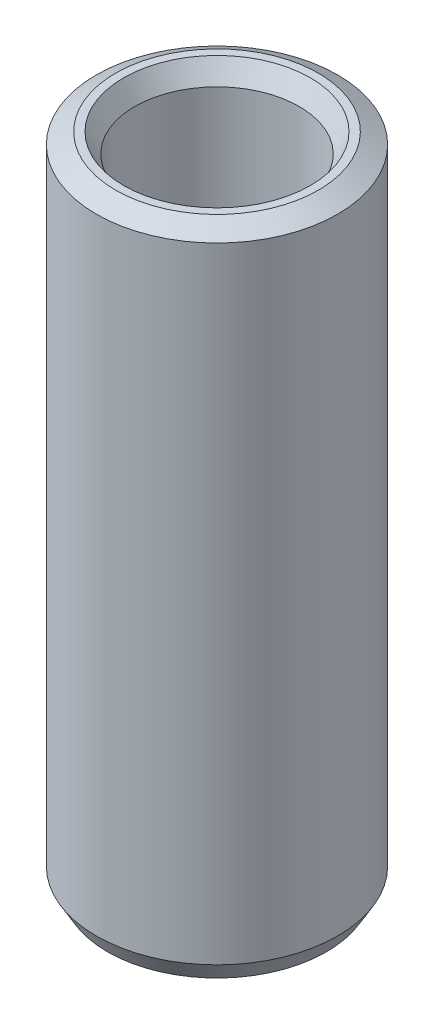
ISO-10303-21;
HEADER;
FILE_DESCRIPTION(('STEP AP214'),'2;1');
FILE_NAME('part.step','',(''),(''),'','','');
FILE_SCHEMA(('AUTOMOTIVE_DESIGN { 1 0 10303 214 1 1 1 1 }'));
ENDSEC;
DATA;
#1=APPLICATION_CONTEXT('core data for automotive mechanical design processes');
#2=APPLICATION_PROTOCOL_DEFINITION('international standard','automotive_design',2000,#1);
#3=PRODUCT_CONTEXT('',#1,'mechanical');
#4=PRODUCT('Part','Part','',(#3));
#5=PRODUCT_RELATED_PRODUCT_CATEGORY('part','',(#4));
#6=PRODUCT_DEFINITION_FORMATION('','',#4);
#7=PRODUCT_DEFINITION_CONTEXT('part definition',#1,'design');
#8=PRODUCT_DEFINITION('design','',#6,#7);
#9=PRODUCT_DEFINITION_SHAPE('','',#8);
#10=(LENGTH_UNIT() NAMED_UNIT(*) SI_UNIT(.MILLI.,.METRE.));
#11=(NAMED_UNIT(*) PLANE_ANGLE_UNIT() SI_UNIT($,.RADIAN.));
#12=(NAMED_UNIT(*) SI_UNIT($,.STERADIAN.) SOLID_ANGLE_UNIT());
#13=UNCERTAINTY_MEASURE_WITH_UNIT(LENGTH_MEASURE(1.E-05),#10,'distance_accuracy_value','');
#14=(GEOMETRIC_REPRESENTATION_CONTEXT(3) GLOBAL_UNCERTAINTY_ASSIGNED_CONTEXT((#13)) GLOBAL_UNIT_ASSIGNED_CONTEXT((#10,
#11,#12)) REPRESENTATION_CONTEXT('',''));
#15=CARTESIAN_POINT('',(0.,0.,0.));
#16=DIRECTION('',(0.,0.,1.));
#17=DIRECTION('',(1.,0.,0.));
#18=AXIS2_PLACEMENT_3D('',#15,#16,#17);
#19=CARTESIAN_POINT('',(0.,190.138838776829,0.));
#20=DIRECTION('',(0.,-1.,0.));
#21=DIRECTION('',(0.,0.,-1.));
#22=AXIS2_PLACEMENT_3D('',#19,#20,#21);
#23=CYLINDRICAL_SURFACE('',#22,35.);
#24=CARTESIAN_POINT('',(0.,5.59530872607719,0.));
#25=DIRECTION('',(0.,1.,0.));
#26=DIRECTION('',(0.,0.,1.));
#27=AXIS2_PLACEMENT_3D('',#24,#25,#26);
#28=CIRCLE('',#27,35.);
#29=CARTESIAN_POINT('',(0.,5.59530872607719,35.));
#30=VERTEX_POINT('',#29);
#31=EDGE_CURVE('E10',#30,#30,#28,.T.);
#32=ORIENTED_EDGE('',*,*,#31,.T.);
#33=EDGE_LOOP('',(#32));
#34=FACE_BOUND('',#33,.T.);
#35=CARTESIAN_POINT('',(0.,186.908385777629,0.));
#36=DIRECTION('',(0.,1.,0.));
#37=DIRECTION('',(0.,0.,1.));
#38=AXIS2_PLACEMENT_3D('',#35,#36,#37);
#39=CIRCLE('',#38,35.);
#40=CARTESIAN_POINT('',(0.,186.908385777629,35.));
#41=VERTEX_POINT('',#40);
#42=EDGE_CURVE('E50',#41,#41,#39,.F.);
#43=ORIENTED_EDGE('',*,*,#42,.T.);
#44=EDGE_LOOP('',(#43));
#45=FACE_BOUND('',#44,.T.);
#46=ADVANCED_FACE('F39',(#34,#45),#23,.T.);
#47=CARTESIAN_POINT('',(0.,190.138838776829,0.));
#48=DIRECTION('',(0.,1.,0.));
#49=DIRECTION('',(0.,0.,1.));
#50=AXIS2_PLACEMENT_3D('',#47,#48,#49);
#51=PLANE('',#50);
#52=CARTESIAN_POINT('',(0.,190.138838776829,0.));
#53=DIRECTION('',(0.,1.,0.));
#54=DIRECTION('',(0.,0.,1.));
#55=AXIS2_PLACEMENT_3D('',#52,#53,#54);
#56=CIRCLE('',#55,27.0813542651989);
#57=CARTESIAN_POINT('',(0.,190.138838776829,27.0813542651989));
#58=VERTEX_POINT('',#57);
#59=EDGE_CURVE('E58',#58,#58,#56,.F.);
#60=ORIENTED_EDGE('',*,*,#59,.T.);
#61=EDGE_LOOP('',(#60));
#62=FACE_BOUND('',#61,.T.);
#63=CARTESIAN_POINT('',(0.,190.138838776829,0.));
#64=DIRECTION('',(0.,1.,0.));
#65=DIRECTION('',(0.,0.,1.));
#66=AXIS2_PLACEMENT_3D('',#63,#64,#65);
#67=CIRCLE('',#66,29.4046912739228);
#68=CARTESIAN_POINT('',(0.,190.138838776829,29.4046912739228));
#69=VERTEX_POINT('',#68);
#70=EDGE_CURVE('E61',#69,#69,#67,.T.);
#71=ORIENTED_EDGE('',*,*,#70,.T.);
#72=EDGE_LOOP('',(#71));
#73=FACE_BOUND('',#72,.T.);
#74=ADVANCED_FACE('F88',(#62,#73),#51,.T.);
#75=CARTESIAN_POINT('',(0.,0.,0.));
#76=DIRECTION('',(0.,1.,0.));
#77=DIRECTION('',(0.,0.,1.));
#78=AXIS2_PLACEMENT_3D('',#75,#76,#77);
#79=PLANE('',#78);
#80=CARTESIAN_POINT('',(0.,0.,0.));
#81=DIRECTION('',(0.,1.,0.));
#82=DIRECTION('',(0.,0.,1.));
#83=AXIS2_PLACEMENT_3D('',#80,#81,#82);
#84=CIRCLE('',#83,29.4462099920765);
#85=CARTESIAN_POINT('',(0.,0.,29.4462099920765));
#86=VERTEX_POINT('',#85);
#87=EDGE_CURVE('E51',#86,#86,#84,.T.);
#88=ORIENTED_EDGE('',*,*,#87,.T.);
#89=EDGE_LOOP('',(#88));
#90=FACE_BOUND('',#89,.T.);
#91=CARTESIAN_POINT('',(0.,0.,0.));
#92=DIRECTION('',(0.,1.,0.));
#93=DIRECTION('',(0.,0.,1.));
#94=AXIS2_PLACEMENT_3D('',#91,#92,#93);
#95=CIRCLE('',#94,31.7695470008003);
#96=CARTESIAN_POINT('',(0.,0.,31.7695470008003));
#97=VERTEX_POINT('',#96);
#98=EDGE_CURVE('E54',#97,#97,#95,.F.);
#99=ORIENTED_EDGE('',*,*,#98,.T.);
#100=EDGE_LOOP('',(#99));
#101=FACE_BOUND('',#100,.T.);
#102=ADVANCED_FACE('F83',(#90,#101),#79,.F.);
#103=CARTESIAN_POINT('',(0.,190.138838776829,0.));
#104=DIRECTION('',(0.,-1.,0.));
#105=DIRECTION('',(0.,0.,-1.));
#106=AXIS2_PLACEMENT_3D('',#103,#104,#105);
#107=CYLINDRICAL_SURFACE('',#106,23.8509012659992);
#108=CARTESIAN_POINT('',(0.,184.543530050752,0.));
#109=DIRECTION('',(0.,1.,0.));
#110=DIRECTION('',(0.,0.,1.));
#111=AXIS2_PLACEMENT_3D('',#108,#109,#110);
#112=CIRCLE('',#111,23.8509012659992);
#113=CARTESIAN_POINT('',(0.,184.543530050752,23.8509012659992));
#114=VERTEX_POINT('',#113);
#115=EDGE_CURVE('E67',#114,#114,#112,.T.);
#116=ORIENTED_EDGE('',*,*,#115,.T.);
#117=EDGE_LOOP('',(#116));
#118=FACE_BOUND('',#117,.T.);
#119=CARTESIAN_POINT('',(0.,3.23045299919983,0.));
#120=DIRECTION('',(0.,1.,0.));
#121=DIRECTION('',(0.,0.,1.));
#122=AXIS2_PLACEMENT_3D('',#119,#120,#121);
#123=CIRCLE('',#122,23.8509012659992);
#124=CARTESIAN_POINT('',(0.,3.23045299919983,23.8509012659992));
#125=VERTEX_POINT('',#124);
#126=EDGE_CURVE('E69',#125,#125,#123,.F.);
#127=ORIENTED_EDGE('',*,*,#126,.T.);
#128=EDGE_LOOP('',(#127));
#129=FACE_BOUND('',#128,.T.);
#130=ADVANCED_FACE('F71',(#118,#129),#107,.F.);
#131=CARTESIAN_POINT('',(0.,184.543530050752,0.));
#132=DIRECTION('',(0.,1.,0.));
#133=DIRECTION('',(0.,0.,1.));
#134=AXIS2_PLACEMENT_3D('',#131,#132,#133);
#135=CONICAL_SURFACE('',#134,23.8509012659992,0.523598775598299);
#136=ORIENTED_EDGE('',*,*,#59,.F.);
#137=EDGE_LOOP('',(#136));
#138=FACE_BOUND('',#137,.T.);
#139=ORIENTED_EDGE('',*,*,#115,.F.);
#140=EDGE_LOOP('',(#139));
#141=FACE_BOUND('',#140,.T.);
#142=ADVANCED_FACE('F77',(#138,#141),#135,.F.);
#143=CARTESIAN_POINT('',(0.,0.,0.));
#144=DIRECTION('',(0.,-1.,0.));
#145=DIRECTION('',(0.,0.,-1.));
#146=AXIS2_PLACEMENT_3D('',#143,#144,#145);
#147=CONICAL_SURFACE('',#146,29.4462099920765,1.04719755119659);
#148=ORIENTED_EDGE('',*,*,#126,.F.);
#149=EDGE_LOOP('',(#148));
#150=FACE_BOUND('',#149,.T.);
#151=ORIENTED_EDGE('',*,*,#87,.F.);
#152=EDGE_LOOP('',(#151));
#153=FACE_BOUND('',#152,.T.);
#154=ADVANCED_FACE('F73',(#150,#153),#147,.F.);
#155=CARTESIAN_POINT('',(0.,5.59530872607719,0.));
#156=DIRECTION('',(0.,1.,0.));
#157=DIRECTION('',(0.,0.,1.));
#158=AXIS2_PLACEMENT_3D('',#155,#156,#157);
#159=CONICAL_SURFACE('',#158,35.,0.523598775598302);
#160=ORIENTED_EDGE('',*,*,#98,.F.);
#161=EDGE_LOOP('',(#160));
#162=FACE_BOUND('',#161,.T.);
#163=ORIENTED_EDGE('',*,*,#31,.F.);
#164=EDGE_LOOP('',(#163));
#165=FACE_BOUND('',#164,.T.);
#166=ADVANCED_FACE('F76',(#162,#165),#159,.T.);
#167=CARTESIAN_POINT('',(0.,190.138838776829,0.));
#168=DIRECTION('',(0.,-1.,0.));
#169=DIRECTION('',(0.,0.,-1.));
#170=AXIS2_PLACEMENT_3D('',#167,#168,#169);
#171=CONICAL_SURFACE('',#170,29.4046912739228,1.04719755119659);
#172=ORIENTED_EDGE('',*,*,#42,.F.);
#173=EDGE_LOOP('',(#172));
#174=FACE_BOUND('',#173,.T.);
#175=ORIENTED_EDGE('',*,*,#70,.F.);
#176=EDGE_LOOP('',(#175));
#177=FACE_BOUND('',#176,.T.);
#178=ADVANCED_FACE('F45',(#174,#177),#171,.T.);
#179=CLOSED_SHELL('',(#46,#74,#102,#130,#142,#154,#166,#178));
#180=MANIFOLD_SOLID_BREP('B2',#179);
#181=ADVANCED_BREP_SHAPE_REPRESENTATION('',(#18,#180),#14);
#182=SHAPE_DEFINITION_REPRESENTATION(#9,#181);
ENDSEC;
END-ISO-10303-21;
